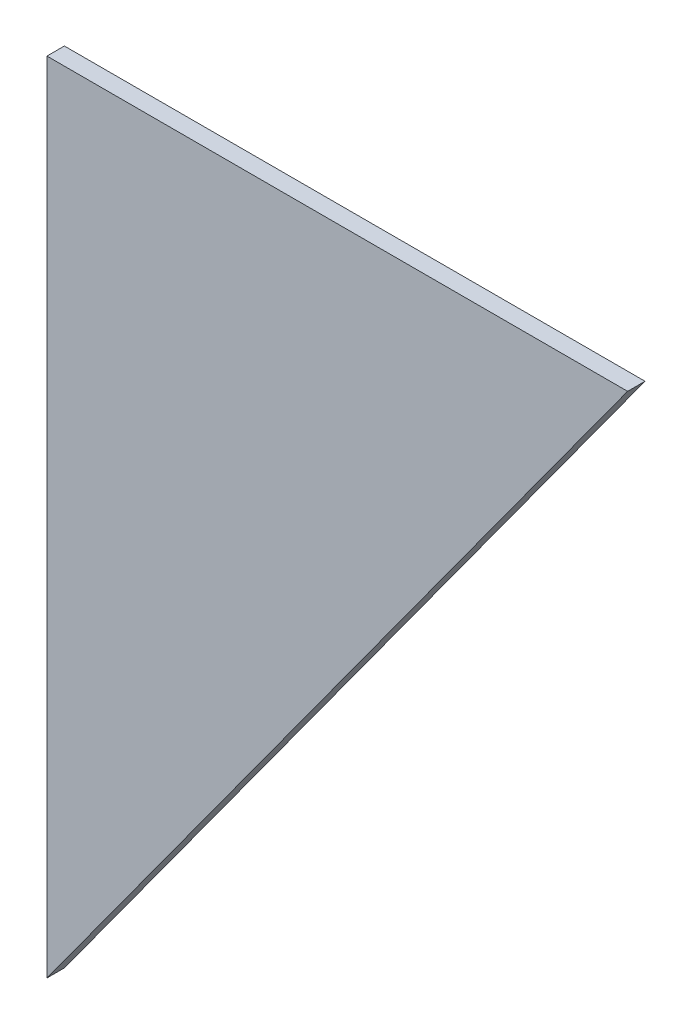
ISO-10303-21;
HEADER;
FILE_DESCRIPTION(('STEP AP214'),'2;1');
FILE_NAME('part.step','',(''),(''),'','','');
FILE_SCHEMA(('AUTOMOTIVE_DESIGN { 1 0 10303 214 1 1 1 1 }'));
ENDSEC;
DATA;
#1=APPLICATION_CONTEXT('core data for automotive mechanical design processes');
#2=APPLICATION_PROTOCOL_DEFINITION('international standard','automotive_design',2000,#1);
#3=PRODUCT_CONTEXT('',#1,'mechanical');
#4=PRODUCT('Part','Part','',(#3));
#5=PRODUCT_RELATED_PRODUCT_CATEGORY('part','',(#4));
#6=PRODUCT_DEFINITION_FORMATION('','',#4);
#7=PRODUCT_DEFINITION_CONTEXT('part definition',#1,'design');
#8=PRODUCT_DEFINITION('design','',#6,#7);
#9=PRODUCT_DEFINITION_SHAPE('','',#8);
#10=(LENGTH_UNIT() NAMED_UNIT(*) SI_UNIT(.MILLI.,.METRE.));
#11=(NAMED_UNIT(*) PLANE_ANGLE_UNIT() SI_UNIT($,.RADIAN.));
#12=(NAMED_UNIT(*) SI_UNIT($,.STERADIAN.) SOLID_ANGLE_UNIT());
#13=UNCERTAINTY_MEASURE_WITH_UNIT(LENGTH_MEASURE(1.E-05),#10,'distance_accuracy_value','');
#14=(GEOMETRIC_REPRESENTATION_CONTEXT(3) GLOBAL_UNCERTAINTY_ASSIGNED_CONTEXT((#13)) GLOBAL_UNIT_ASSIGNED_CONTEXT((#10,
#11,#12)) REPRESENTATION_CONTEXT('',''));
#15=CARTESIAN_POINT('',(0.,0.,0.));
#16=DIRECTION('',(0.,0.,1.));
#17=DIRECTION('',(1.,0.,0.));
#18=AXIS2_PLACEMENT_3D('',#15,#16,#17);
#19=CARTESIAN_POINT('',(101.6,139.7,3.048));
#20=DIRECTION('',(-0.808736084303188,0.588171697675046,0.));
#21=DIRECTION('',(-0.588171697675046,-0.808736084303189,0.));
#22=AXIS2_PLACEMENT_3D('',#19,#20,#21);
#23=PLANE('',#22);
#24=DIRECTION('',(0.588171697675046,0.808736084303189,0.));
#25=VECTOR('',#24,1.);
#26=CARTESIAN_POINT('',(101.6,139.7,0.));
#27=LINE('',#26,#25);
#28=CARTESIAN_POINT('',(0.,0.,0.));
#29=VERTEX_POINT('',#28);
#30=CARTESIAN_POINT('',(101.6,139.7,0.));
#31=VERTEX_POINT('',#30);
#32=EDGE_CURVE('E81',#29,#31,#27,.T.);
#33=ORIENTED_EDGE('',*,*,#32,.T.);
#34=DIRECTION('',(0.,0.,-1.));
#35=VECTOR('',#34,1.);
#36=CARTESIAN_POINT('',(101.6,139.7,3.048));
#37=LINE('',#36,#35);
#38=CARTESIAN_POINT('',(101.6,139.7,3.048));
#39=VERTEX_POINT('',#38);
#40=EDGE_CURVE('E11',#39,#31,#37,.T.);
#41=ORIENTED_EDGE('',*,*,#40,.F.);
#42=DIRECTION('',(0.588171697675046,0.808736084303189,0.));
#43=VECTOR('',#42,1.);
#44=CARTESIAN_POINT('',(101.6,139.7,3.048));
#45=LINE('',#44,#43);
#46=CARTESIAN_POINT('',(0.,0.,3.048));
#47=VERTEX_POINT('',#46);
#48=EDGE_CURVE('E74',#47,#39,#45,.T.);
#49=ORIENTED_EDGE('',*,*,#48,.F.);
#50=DIRECTION('',(0.,0.,-1.));
#51=VECTOR('',#50,1.);
#52=CARTESIAN_POINT('',(0.,0.,3.048));
#53=LINE('',#52,#51);
#54=EDGE_CURVE('E82',#47,#29,#53,.T.);
#55=ORIENTED_EDGE('',*,*,#54,.T.);
#56=EDGE_LOOP('',(#33,#41,#49,#55));
#57=FACE_BOUND('',#56,.T.);
#58=ADVANCED_FACE('F34',(#57),#23,.F.);
#59=CARTESIAN_POINT('',(0.,139.7,3.048));
#60=DIRECTION('',(0.,-1.,0.));
#61=DIRECTION('',(0.,0.,-1.));
#62=AXIS2_PLACEMENT_3D('',#59,#60,#61);
#63=PLANE('',#62);
#64=DIRECTION('',(-1.,0.,0.));
#65=VECTOR('',#64,1.);
#66=CARTESIAN_POINT('',(0.,139.7,0.));
#67=LINE('',#66,#65);
#68=CARTESIAN_POINT('',(0.,139.7,0.));
#69=VERTEX_POINT('',#68);
#70=EDGE_CURVE('E62',#31,#69,#67,.T.);
#71=ORIENTED_EDGE('',*,*,#70,.T.);
#72=DIRECTION('',(0.,0.,-1.));
#73=VECTOR('',#72,1.);
#74=CARTESIAN_POINT('',(0.,139.7,3.048));
#75=LINE('',#74,#73);
#76=CARTESIAN_POINT('',(0.,139.7,3.048));
#77=VERTEX_POINT('',#76);
#78=EDGE_CURVE('E42',#77,#69,#75,.T.);
#79=ORIENTED_EDGE('',*,*,#78,.F.);
#80=DIRECTION('',(-1.,0.,0.));
#81=VECTOR('',#80,1.);
#82=CARTESIAN_POINT('',(0.,139.7,3.048));
#83=LINE('',#82,#81);
#84=EDGE_CURVE('E70',#39,#77,#83,.T.);
#85=ORIENTED_EDGE('',*,*,#84,.F.);
#86=ORIENTED_EDGE('',*,*,#40,.T.);
#87=EDGE_LOOP('',(#71,#79,#85,#86));
#88=FACE_BOUND('',#87,.T.);
#89=ADVANCED_FACE('F71',(#88),#63,.F.);
#90=CARTESIAN_POINT('',(0.,0.,3.048));
#91=DIRECTION('',(1.,0.,0.));
#92=DIRECTION('',(0.,0.,-1.));
#93=AXIS2_PLACEMENT_3D('',#90,#91,#92);
#94=PLANE('',#93);
#95=DIRECTION('',(0.,-1.,0.));
#96=VECTOR('',#95,1.);
#97=CARTESIAN_POINT('',(0.,0.,0.));
#98=LINE('',#97,#96);
#99=EDGE_CURVE('E67',#69,#29,#98,.T.);
#100=ORIENTED_EDGE('',*,*,#99,.T.);
#101=ORIENTED_EDGE('',*,*,#54,.F.);
#102=DIRECTION('',(0.,-1.,0.));
#103=VECTOR('',#102,1.);
#104=CARTESIAN_POINT('',(0.,0.,3.048));
#105=LINE('',#104,#103);
#106=EDGE_CURVE('E50',#77,#47,#105,.T.);
#107=ORIENTED_EDGE('',*,*,#106,.F.);
#108=ORIENTED_EDGE('',*,*,#78,.T.);
#109=EDGE_LOOP('',(#100,#101,#107,#108));
#110=FACE_BOUND('',#109,.T.);
#111=ADVANCED_FACE('F89',(#110),#94,.F.);
#112=CARTESIAN_POINT('',(0.,0.,3.048));
#113=DIRECTION('',(0.,0.,1.));
#114=DIRECTION('',(1.,0.,0.));
#115=AXIS2_PLACEMENT_3D('',#112,#113,#114);
#116=PLANE('',#115);
#117=ORIENTED_EDGE('',*,*,#48,.T.);
#118=ORIENTED_EDGE('',*,*,#84,.T.);
#119=ORIENTED_EDGE('',*,*,#106,.T.);
#120=EDGE_LOOP('',(#117,#118,#119));
#121=FACE_BOUND('',#120,.T.);
#122=ADVANCED_FACE('F77',(#121),#116,.T.);
#123=CARTESIAN_POINT('',(0.,0.,0.));
#124=DIRECTION('',(0.,0.,1.));
#125=DIRECTION('',(1.,0.,0.));
#126=AXIS2_PLACEMENT_3D('',#123,#124,#125);
#127=PLANE('',#126);
#128=ORIENTED_EDGE('',*,*,#32,.F.);
#129=ORIENTED_EDGE('',*,*,#99,.F.);
#130=ORIENTED_EDGE('',*,*,#70,.F.);
#131=EDGE_LOOP('',(#128,#129,#130));
#132=FACE_BOUND('',#131,.T.);
#133=ADVANCED_FACE('F90',(#132),#127,.F.);
#134=CLOSED_SHELL('',(#58,#89,#111,#122,#133));
#135=MANIFOLD_SOLID_BREP('B2',#134);
#136=ADVANCED_BREP_SHAPE_REPRESENTATION('',(#18,#135),#14);
#137=SHAPE_DEFINITION_REPRESENTATION(#9,#136);
ENDSEC;
END-ISO-10303-21;
